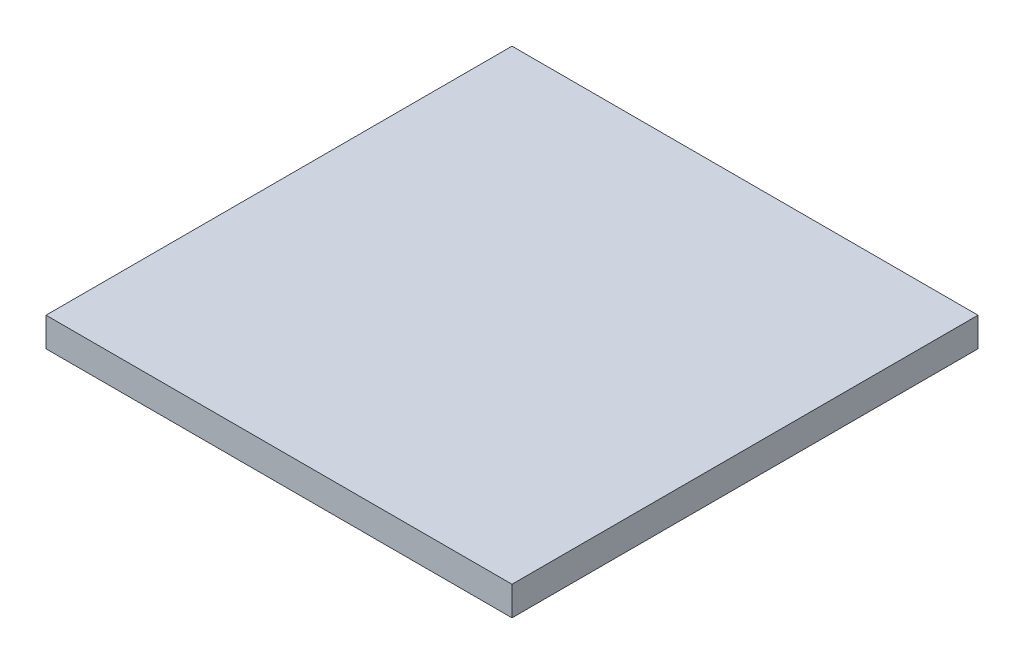
ISO-10303-21;
HEADER;
FILE_DESCRIPTION(('STEP AP214'),'2;1');
FILE_NAME('part.step','',(''),(''),'','','');
FILE_SCHEMA(('AUTOMOTIVE_DESIGN { 1 0 10303 214 1 1 1 1 }'));
ENDSEC;
DATA;
#1=APPLICATION_CONTEXT('core data for automotive mechanical design processes');
#2=APPLICATION_PROTOCOL_DEFINITION('international standard','automotive_design',2000,#1);
#3=PRODUCT_CONTEXT('',#1,'mechanical');
#4=PRODUCT('Part','Part','',(#3));
#5=PRODUCT_RELATED_PRODUCT_CATEGORY('part','',(#4));
#6=PRODUCT_DEFINITION_FORMATION('','',#4);
#7=PRODUCT_DEFINITION_CONTEXT('part definition',#1,'design');
#8=PRODUCT_DEFINITION('design','',#6,#7);
#9=PRODUCT_DEFINITION_SHAPE('','',#8);
#10=(LENGTH_UNIT() NAMED_UNIT(*) SI_UNIT(.MILLI.,.METRE.));
#11=(NAMED_UNIT(*) PLANE_ANGLE_UNIT() SI_UNIT($,.RADIAN.));
#12=(NAMED_UNIT(*) SI_UNIT($,.STERADIAN.) SOLID_ANGLE_UNIT());
#13=UNCERTAINTY_MEASURE_WITH_UNIT(LENGTH_MEASURE(1.E-05),#10,'distance_accuracy_value','');
#14=(GEOMETRIC_REPRESENTATION_CONTEXT(3) GLOBAL_UNCERTAINTY_ASSIGNED_CONTEXT((#13)) GLOBAL_UNIT_ASSIGNED_CONTEXT((#10,
#11,#12)) REPRESENTATION_CONTEXT('',''));
#15=CARTESIAN_POINT('',(0.,0.,0.));
#16=DIRECTION('',(0.,0.,1.));
#17=DIRECTION('',(1.,0.,0.));
#18=AXIS2_PLACEMENT_3D('',#15,#16,#17);
#19=CARTESIAN_POINT('',(0.,4.7625,0.));
#20=DIRECTION('',(1.,0.,0.));
#21=DIRECTION('',(0.,0.,-1.));
#22=AXIS2_PLACEMENT_3D('',#19,#20,#21);
#23=PLANE('',#22);
#24=DIRECTION('',(0.,0.,1.));
#25=VECTOR('',#24,1.);
#26=CARTESIAN_POINT('',(0.,0.,0.));
#27=LINE('',#26,#25);
#28=CARTESIAN_POINT('',(0.,0.,0.));
#29=VERTEX_POINT('',#28);
#30=CARTESIAN_POINT('',(0.,0.,76.2));
#31=VERTEX_POINT('',#30);
#32=EDGE_CURVE('E96',#29,#31,#27,.T.);
#33=ORIENTED_EDGE('',*,*,#32,.T.);
#34=DIRECTION('',(0.,-1.,0.));
#35=VECTOR('',#34,1.);
#36=CARTESIAN_POINT('',(0.,4.7625,76.2));
#37=LINE('',#36,#35);
#38=CARTESIAN_POINT('',(0.,4.7625,76.2));
#39=VERTEX_POINT('',#38);
#40=EDGE_CURVE('E11',#39,#31,#37,.T.);
#41=ORIENTED_EDGE('',*,*,#40,.F.);
#42=DIRECTION('',(0.,0.,1.));
#43=VECTOR('',#42,1.);
#44=CARTESIAN_POINT('',(0.,4.7625,0.));
#45=LINE('',#44,#43);
#46=CARTESIAN_POINT('',(0.,4.7625,0.));
#47=VERTEX_POINT('',#46);
#48=EDGE_CURVE('E82',#47,#39,#45,.T.);
#49=ORIENTED_EDGE('',*,*,#48,.F.);
#50=DIRECTION('',(0.,-1.,0.));
#51=VECTOR('',#50,1.);
#52=CARTESIAN_POINT('',(0.,4.7625,0.));
#53=LINE('',#52,#51);
#54=EDGE_CURVE('E49',#47,#29,#53,.T.);
#55=ORIENTED_EDGE('',*,*,#54,.T.);
#56=EDGE_LOOP('',(#33,#41,#49,#55));
#57=FACE_BOUND('',#56,.T.);
#58=ADVANCED_FACE('F33',(#57),#23,.F.);
#59=CARTESIAN_POINT('',(0.,4.7625,76.2));
#60=DIRECTION('',(0.,0.,-1.));
#61=DIRECTION('',(-1.,0.,0.));
#62=AXIS2_PLACEMENT_3D('',#59,#60,#61);
#63=PLANE('',#62);
#64=DIRECTION('',(1.,0.,0.));
#65=VECTOR('',#64,1.);
#66=CARTESIAN_POINT('',(0.,0.,76.2));
#67=LINE('',#66,#65);
#68=CARTESIAN_POINT('',(76.2,0.,76.2));
#69=VERTEX_POINT('',#68);
#70=EDGE_CURVE('E87',#31,#69,#67,.T.);
#71=ORIENTED_EDGE('',*,*,#70,.T.);
#72=DIRECTION('',(0.,-1.,0.));
#73=VECTOR('',#72,1.);
#74=CARTESIAN_POINT('',(76.2,4.7625,76.2));
#75=LINE('',#74,#73);
#76=CARTESIAN_POINT('',(76.2,4.7625,76.2));
#77=VERTEX_POINT('',#76);
#78=EDGE_CURVE('E41',#77,#69,#75,.T.);
#79=ORIENTED_EDGE('',*,*,#78,.F.);
#80=DIRECTION('',(1.,0.,0.));
#81=VECTOR('',#80,1.);
#82=CARTESIAN_POINT('',(0.,4.7625,76.2));
#83=LINE('',#82,#81);
#84=EDGE_CURVE('E74',#39,#77,#83,.T.);
#85=ORIENTED_EDGE('',*,*,#84,.F.);
#86=ORIENTED_EDGE('',*,*,#40,.T.);
#87=EDGE_LOOP('',(#71,#79,#85,#86));
#88=FACE_BOUND('',#87,.T.);
#89=ADVANCED_FACE('F86',(#88),#63,.F.);
#90=CARTESIAN_POINT('',(76.2,4.7625,0.));
#91=DIRECTION('',(1.,0.,0.));
#92=DIRECTION('',(0.,0.,-1.));
#93=AXIS2_PLACEMENT_3D('',#90,#91,#92);
#94=PLANE('',#93);
#95=DIRECTION('',(0.,0.,1.));
#96=VECTOR('',#95,1.);
#97=CARTESIAN_POINT('',(76.2,0.,0.));
#98=LINE('',#97,#96);
#99=CARTESIAN_POINT('',(76.2,0.,0.));
#100=VERTEX_POINT('',#99);
#101=EDGE_CURVE('E99',#100,#69,#98,.T.);
#102=ORIENTED_EDGE('',*,*,#101,.F.);
#103=DIRECTION('',(0.,-1.,0.));
#104=VECTOR('',#103,1.);
#105=CARTESIAN_POINT('',(76.2,4.7625,0.));
#106=LINE('',#105,#104);
#107=CARTESIAN_POINT('',(76.2,4.7625,0.));
#108=VERTEX_POINT('',#107);
#109=EDGE_CURVE('E63',#108,#100,#106,.T.);
#110=ORIENTED_EDGE('',*,*,#109,.F.);
#111=DIRECTION('',(0.,0.,1.));
#112=VECTOR('',#111,1.);
#113=CARTESIAN_POINT('',(76.2,4.7625,0.));
#114=LINE('',#113,#112);
#115=EDGE_CURVE('E81',#108,#77,#114,.T.);
#116=ORIENTED_EDGE('',*,*,#115,.T.);
#117=ORIENTED_EDGE('',*,*,#78,.T.);
#118=EDGE_LOOP('',(#102,#110,#116,#117));
#119=FACE_BOUND('',#118,.T.);
#120=ADVANCED_FACE('F90',(#119),#94,.T.);
#121=CARTESIAN_POINT('',(0.,4.7625,0.));
#122=DIRECTION('',(0.,0.,-1.));
#123=DIRECTION('',(-1.,0.,0.));
#124=AXIS2_PLACEMENT_3D('',#121,#122,#123);
#125=PLANE('',#124);
#126=DIRECTION('',(1.,0.,0.));
#127=VECTOR('',#126,1.);
#128=CARTESIAN_POINT('',(0.,0.,0.));
#129=LINE('',#128,#127);
#130=EDGE_CURVE('E101',#29,#100,#129,.T.);
#131=ORIENTED_EDGE('',*,*,#130,.F.);
#132=ORIENTED_EDGE('',*,*,#54,.F.);
#133=DIRECTION('',(1.,0.,0.));
#134=VECTOR('',#133,1.);
#135=CARTESIAN_POINT('',(0.,4.7625,0.));
#136=LINE('',#135,#134);
#137=EDGE_CURVE('E91',#47,#108,#136,.T.);
#138=ORIENTED_EDGE('',*,*,#137,.T.);
#139=ORIENTED_EDGE('',*,*,#109,.T.);
#140=EDGE_LOOP('',(#131,#132,#138,#139));
#141=FACE_BOUND('',#140,.T.);
#142=ADVANCED_FACE('F107',(#141),#125,.T.);
#143=CARTESIAN_POINT('',(0.,4.7625,0.));
#144=DIRECTION('',(0.,1.,0.));
#145=DIRECTION('',(0.,0.,1.));
#146=AXIS2_PLACEMENT_3D('',#143,#144,#145);
#147=PLANE('',#146);
#148=ORIENTED_EDGE('',*,*,#48,.T.);
#149=ORIENTED_EDGE('',*,*,#84,.T.);
#150=ORIENTED_EDGE('',*,*,#115,.F.);
#151=ORIENTED_EDGE('',*,*,#137,.F.);
#152=EDGE_LOOP('',(#148,#149,#150,#151));
#153=FACE_BOUND('',#152,.T.);
#154=ADVANCED_FACE('F78',(#153),#147,.T.);
#155=CARTESIAN_POINT('',(0.,0.,0.));
#156=DIRECTION('',(0.,1.,0.));
#157=DIRECTION('',(0.,0.,1.));
#158=AXIS2_PLACEMENT_3D('',#155,#156,#157);
#159=PLANE('',#158);
#160=ORIENTED_EDGE('',*,*,#32,.F.);
#161=ORIENTED_EDGE('',*,*,#130,.T.);
#162=ORIENTED_EDGE('',*,*,#101,.T.);
#163=ORIENTED_EDGE('',*,*,#70,.F.);
#164=EDGE_LOOP('',(#160,#161,#162,#163));
#165=FACE_BOUND('',#164,.T.);
#166=ADVANCED_FACE('F106',(#165),#159,.F.);
#167=CLOSED_SHELL('',(#58,#89,#120,#142,#154,#166));
#168=MANIFOLD_SOLID_BREP('B2',#167);
#169=ADVANCED_BREP_SHAPE_REPRESENTATION('',(#18,#168),#14);
#170=SHAPE_DEFINITION_REPRESENTATION(#9,#169);
ENDSEC;
END-ISO-10303-21;
